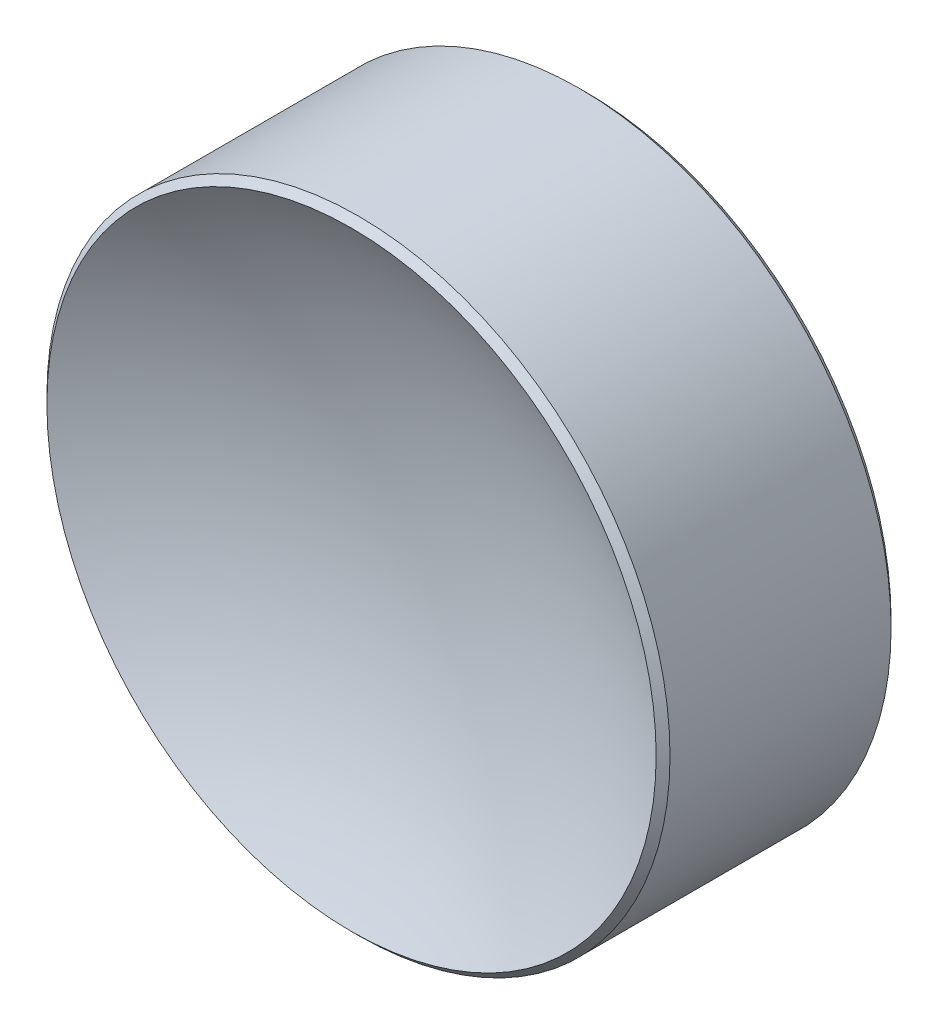
ISO-10303-21;
HEADER;
FILE_DESCRIPTION(('STEP AP214'),'2;1');
FILE_NAME('part.step','',(''),(''),'','','');
FILE_SCHEMA(('AUTOMOTIVE_DESIGN { 1 0 10303 214 1 1 1 1 }'));
ENDSEC;
DATA;
#1=APPLICATION_CONTEXT('core data for automotive mechanical design processes');
#2=APPLICATION_PROTOCOL_DEFINITION('international standard','automotive_design',2000,#1);
#3=PRODUCT_CONTEXT('',#1,'mechanical');
#4=PRODUCT('Part','Part','',(#3));
#5=PRODUCT_RELATED_PRODUCT_CATEGORY('part','',(#4));
#6=PRODUCT_DEFINITION_FORMATION('','',#4);
#7=PRODUCT_DEFINITION_CONTEXT('part definition',#1,'design');
#8=PRODUCT_DEFINITION('design','',#6,#7);
#9=PRODUCT_DEFINITION_SHAPE('','',#8);
#10=(LENGTH_UNIT() NAMED_UNIT(*) SI_UNIT(.MILLI.,.METRE.));
#11=(NAMED_UNIT(*) PLANE_ANGLE_UNIT() SI_UNIT($,.RADIAN.));
#12=(NAMED_UNIT(*) SI_UNIT($,.STERADIAN.) SOLID_ANGLE_UNIT());
#13=UNCERTAINTY_MEASURE_WITH_UNIT(LENGTH_MEASURE(1.E-05),#10,'distance_accuracy_value','');
#14=(GEOMETRIC_REPRESENTATION_CONTEXT(3) GLOBAL_UNCERTAINTY_ASSIGNED_CONTEXT((#13)) GLOBAL_UNIT_ASSIGNED_CONTEXT((#10,
#11,#12)) REPRESENTATION_CONTEXT('',''));
#15=CARTESIAN_POINT('',(0.,0.,0.));
#16=DIRECTION('',(0.,0.,1.));
#17=DIRECTION('',(1.,0.,0.));
#18=AXIS2_PLACEMENT_3D('',#15,#16,#17);
#19=CARTESIAN_POINT('',(0.,0.,13.17));
#20=DIRECTION('',(0.,0.,1.));
#21=DIRECTION('',(0.,1.,0.));
#22=AXIS2_PLACEMENT_3D('',#19,#20,#21);
#23=SPHERICAL_SURFACE('',#22,11.67);
#24=CARTESIAN_POINT('',(0.,0.,3.28858050560478));
#25=DIRECTION('',(0.,0.,1.));
#26=DIRECTION('',(1.,0.,0.));
#27=AXIS2_PLACEMENT_3D('',#24,#25,#26);
#28=CIRCLE('',#27,6.20857864376269);
#29=CARTESIAN_POINT('',(6.20857864376269,0.,3.28858050560478));
#30=VERTEX_POINT('',#29);
#31=EDGE_CURVE('E27',#30,#30,#28,.T.);
#32=ORIENTED_EDGE('',*,*,#31,.T.);
#33=EDGE_LOOP('',(#32));
#34=FACE_BOUND('',#33,.T.);
#35=ADVANCED_FACE('F13',(#34),#23,.F.);
#36=CARTESIAN_POINT('',(0.,0.,-1.5));
#37=DIRECTION('',(0.,0.,1.));
#38=DIRECTION('',(1.,0.,0.));
#39=AXIS2_PLACEMENT_3D('',#36,#37,#38);
#40=PLANE('',#39);
#41=CARTESIAN_POINT('',(0.,0.,-1.5));
#42=DIRECTION('',(0.,0.,1.));
#43=DIRECTION('',(1.,0.,0.));
#44=AXIS2_PLACEMENT_3D('',#41,#42,#43);
#45=CIRCLE('',#44,6.20857864376269);
#46=CARTESIAN_POINT('',(6.20857864376269,0.,-1.5));
#47=VERTEX_POINT('',#46);
#48=EDGE_CURVE('E9',#47,#47,#45,.T.);
#49=ORIENTED_EDGE('',*,*,#48,.F.);
#50=EDGE_LOOP('',(#49));
#51=FACE_BOUND('',#50,.T.);
#52=ADVANCED_FACE('F49',(#51),#40,.F.);
#53=CARTESIAN_POINT('',(0.,0.,-1.5));
#54=DIRECTION('',(0.,0.,1.));
#55=DIRECTION('',(1.,0.,0.));
#56=AXIS2_PLACEMENT_3D('',#53,#54,#55);
#57=CONICAL_SURFACE('',#56,6.20857864376269,0.785398163397454);
#58=CARTESIAN_POINT('',(0.,0.,-1.35857864376269));
#59=DIRECTION('',(0.,0.,1.));
#60=DIRECTION('',(1.,0.,0.));
#61=AXIS2_PLACEMENT_3D('',#58,#59,#60);
#62=CIRCLE('',#61,6.35);
#63=CARTESIAN_POINT('',(6.35,0.,-1.35857864376269));
#64=VERTEX_POINT('',#63);
#65=EDGE_CURVE('E19',#64,#64,#62,.T.);
#66=ORIENTED_EDGE('',*,*,#65,.F.);
#67=EDGE_LOOP('',(#66));
#68=FACE_BOUND('',#67,.T.);
#69=ORIENTED_EDGE('',*,*,#48,.T.);
#70=EDGE_LOOP('',(#69));
#71=FACE_BOUND('',#70,.T.);
#72=ADVANCED_FACE('F42',(#68,#71),#57,.T.);
#73=CARTESIAN_POINT('',(0.,0.,9.01715327042933));
#74=DIRECTION('',(0.,0.,1.));
#75=DIRECTION('',(1.,0.,0.));
#76=AXIS2_PLACEMENT_3D('',#73,#74,#75);
#77=CYLINDRICAL_SURFACE('',#76,6.35);
#78=CARTESIAN_POINT('',(0.,0.,3.14715914936747));
#79=DIRECTION('',(0.,0.,1.));
#80=DIRECTION('',(1.,0.,0.));
#81=AXIS2_PLACEMENT_3D('',#78,#79,#80);
#82=CIRCLE('',#81,6.35);
#83=CARTESIAN_POINT('',(6.35,0.,3.14715914936747));
#84=VERTEX_POINT('',#83);
#85=EDGE_CURVE('E23',#84,#84,#82,.T.);
#86=ORIENTED_EDGE('',*,*,#85,.F.);
#87=EDGE_LOOP('',(#86));
#88=FACE_BOUND('',#87,.T.);
#89=ORIENTED_EDGE('',*,*,#65,.T.);
#90=EDGE_LOOP('',(#89));
#91=FACE_BOUND('',#90,.T.);
#92=ADVANCED_FACE('F37',(#88,#91),#77,.T.);
#93=CARTESIAN_POINT('',(0.,0.,3.14715914936747));
#94=DIRECTION('',(0.,0.,-1.));
#95=DIRECTION('',(-1.,0.,0.));
#96=AXIS2_PLACEMENT_3D('',#93,#94,#95);
#97=CONICAL_SURFACE('',#96,6.35,0.785398163397433);
#98=ORIENTED_EDGE('',*,*,#31,.F.);
#99=EDGE_LOOP('',(#98));
#100=FACE_BOUND('',#99,.T.);
#101=ORIENTED_EDGE('',*,*,#85,.T.);
#102=EDGE_LOOP('',(#101));
#103=FACE_BOUND('',#102,.T.);
#104=ADVANCED_FACE('F34',(#100,#103),#97,.T.);
#105=CLOSED_SHELL('',(#35,#52,#72,#92,#104));
#106=MANIFOLD_SOLID_BREP('B1',#105);
#107=ADVANCED_BREP_SHAPE_REPRESENTATION('',(#18,#106),#14);
#108=SHAPE_DEFINITION_REPRESENTATION(#9,#107);
ENDSEC;
END-ISO-10303-21;
